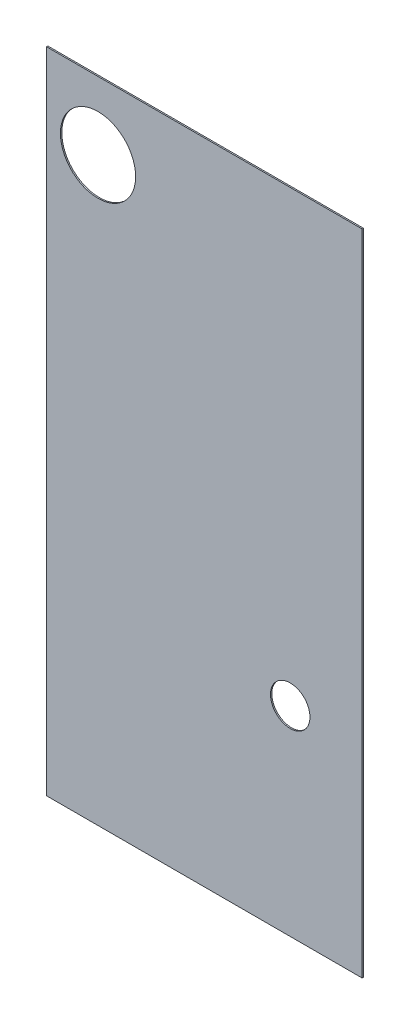
ISO-10303-21;
HEADER;
FILE_DESCRIPTION(('STEP AP214'),'2;1');
FILE_NAME('part.step','',(''),(''),'','','');
FILE_SCHEMA(('AUTOMOTIVE_DESIGN { 1 0 10303 214 1 1 1 1 }'));
ENDSEC;
DATA;
#1=APPLICATION_CONTEXT('core data for automotive mechanical design processes');
#2=APPLICATION_PROTOCOL_DEFINITION('international standard','automotive_design',2000,#1);
#3=PRODUCT_CONTEXT('',#1,'mechanical');
#4=PRODUCT('Part','Part','',(#3));
#5=PRODUCT_RELATED_PRODUCT_CATEGORY('part','',(#4));
#6=PRODUCT_DEFINITION_FORMATION('','',#4);
#7=PRODUCT_DEFINITION_CONTEXT('part definition',#1,'design');
#8=PRODUCT_DEFINITION('design','',#6,#7);
#9=PRODUCT_DEFINITION_SHAPE('','',#8);
#10=(LENGTH_UNIT() NAMED_UNIT(*) SI_UNIT(.MILLI.,.METRE.));
#11=(NAMED_UNIT(*) PLANE_ANGLE_UNIT() SI_UNIT($,.RADIAN.));
#12=(NAMED_UNIT(*) SI_UNIT($,.STERADIAN.) SOLID_ANGLE_UNIT());
#13=UNCERTAINTY_MEASURE_WITH_UNIT(LENGTH_MEASURE(1.E-05),#10,'distance_accuracy_value','');
#14=(GEOMETRIC_REPRESENTATION_CONTEXT(3) GLOBAL_UNCERTAINTY_ASSIGNED_CONTEXT((#13)) GLOBAL_UNIT_ASSIGNED_CONTEXT((#10,
#11,#12)) REPRESENTATION_CONTEXT('',''));
#15=CARTESIAN_POINT('',(0.,0.,0.));
#16=DIRECTION('',(0.,0.,1.));
#17=DIRECTION('',(1.,0.,0.));
#18=AXIS2_PLACEMENT_3D('',#15,#16,#17);
#19=CARTESIAN_POINT('',(-13.7388596639054,1442.54174589611,2.54));
#20=DIRECTION('',(-1.,0.,0.));
#21=DIRECTION('',(0.,0.,1.));
#22=AXIS2_PLACEMENT_3D('',#19,#20,#21);
#23=PLANE('',#22);
#24=DIRECTION('',(0.,1.,0.));
#25=VECTOR('',#24,1.);
#26=CARTESIAN_POINT('',(-13.7388596639054,1442.54174589611,0.));
#27=LINE('',#26,#25);
#28=CARTESIAN_POINT('',(-13.7388596639054,198.597905230073,0.));
#29=VERTEX_POINT('',#28);
#30=CARTESIAN_POINT('',(-13.7388596639054,1442.54174589611,0.));
#31=VERTEX_POINT('',#30);
#32=EDGE_CURVE('E96',#29,#31,#27,.T.);
#33=ORIENTED_EDGE('',*,*,#32,.T.);
#34=DIRECTION('',(0.,0.,-1.));
#35=VECTOR('',#34,1.);
#36=CARTESIAN_POINT('',(-13.7388596639054,1442.54174589611,2.54));
#37=LINE('',#36,#35);
#38=CARTESIAN_POINT('',(-13.7388596639054,1442.54174589611,2.54));
#39=VERTEX_POINT('',#38);
#40=EDGE_CURVE('E11',#39,#31,#37,.T.);
#41=ORIENTED_EDGE('',*,*,#40,.F.);
#42=DIRECTION('',(0.,1.,0.));
#43=VECTOR('',#42,1.);
#44=CARTESIAN_POINT('',(-13.7388596639054,1442.54174589611,2.54));
#45=LINE('',#44,#43);
#46=CARTESIAN_POINT('',(-13.7388596639054,198.597905230073,2.54));
#47=VERTEX_POINT('',#46);
#48=EDGE_CURVE('E84',#47,#39,#45,.T.);
#49=ORIENTED_EDGE('',*,*,#48,.F.);
#50=DIRECTION('',(0.,0.,-1.));
#51=VECTOR('',#50,1.);
#52=CARTESIAN_POINT('',(-13.7388596639054,198.597905230073,2.54));
#53=LINE('',#52,#51);
#54=EDGE_CURVE('E92',#47,#29,#53,.T.);
#55=ORIENTED_EDGE('',*,*,#54,.T.);
#56=EDGE_LOOP('',(#33,#41,#49,#55));
#57=FACE_BOUND('',#56,.T.);
#58=ADVANCED_FACE('F33',(#57),#23,.F.);
#59=CARTESIAN_POINT('',(-13.7388596639054,1442.54174589611,2.54));
#60=DIRECTION('',(0.,-1.,0.));
#61=DIRECTION('',(0.,0.,-1.));
#62=AXIS2_PLACEMENT_3D('',#59,#60,#61);
#63=PLANE('',#62);
#64=DIRECTION('',(-1.,0.,0.));
#65=VECTOR('',#64,1.);
#66=CARTESIAN_POINT('',(-13.7388596639054,1442.54174589611,0.));
#67=LINE('',#66,#65);
#68=CARTESIAN_POINT('',(-618.821804827896,1442.54174589611,0.));
#69=VERTEX_POINT('',#68);
#70=EDGE_CURVE('E88',#31,#69,#67,.T.);
#71=ORIENTED_EDGE('',*,*,#70,.T.);
#72=DIRECTION('',(0.,0.,-1.));
#73=VECTOR('',#72,1.);
#74=CARTESIAN_POINT('',(-618.821804827896,1442.54174589611,2.54));
#75=LINE('',#74,#73);
#76=CARTESIAN_POINT('',(-618.821804827896,1442.54174589611,2.54));
#77=VERTEX_POINT('',#76);
#78=EDGE_CURVE('E41',#77,#69,#75,.T.);
#79=ORIENTED_EDGE('',*,*,#78,.F.);
#80=DIRECTION('',(-1.,0.,0.));
#81=VECTOR('',#80,1.);
#82=CARTESIAN_POINT('',(-13.7388596639054,1442.54174589611,2.54));
#83=LINE('',#82,#81);
#84=EDGE_CURVE('E79',#39,#77,#83,.T.);
#85=ORIENTED_EDGE('',*,*,#84,.F.);
#86=ORIENTED_EDGE('',*,*,#40,.T.);
#87=EDGE_LOOP('',(#71,#79,#85,#86));
#88=FACE_BOUND('',#87,.T.);
#89=ADVANCED_FACE('F87',(#88),#63,.F.);
#90=CARTESIAN_POINT('',(-618.821804827896,1442.54174589611,2.54));
#91=DIRECTION('',(1.,0.,0.));
#92=DIRECTION('',(0.,0.,-1.));
#93=AXIS2_PLACEMENT_3D('',#90,#91,#92);
#94=PLANE('',#93);
#95=DIRECTION('',(0.,-1.,0.));
#96=VECTOR('',#95,1.);
#97=CARTESIAN_POINT('',(-618.821804827896,1442.54174589611,0.));
#98=LINE('',#97,#96);
#99=CARTESIAN_POINT('',(-618.821804827896,198.597905230073,0.));
#100=VERTEX_POINT('',#99);
#101=EDGE_CURVE('E66',#69,#100,#98,.T.);
#102=ORIENTED_EDGE('',*,*,#101,.T.);
#103=DIRECTION('',(0.,0.,-1.));
#104=VECTOR('',#103,1.);
#105=CARTESIAN_POINT('',(-618.821804827896,198.597905230073,2.54));
#106=LINE('',#105,#104);
#107=CARTESIAN_POINT('',(-618.821804827896,198.597905230073,2.54));
#108=VERTEX_POINT('',#107);
#109=EDGE_CURVE('E89',#108,#100,#106,.T.);
#110=ORIENTED_EDGE('',*,*,#109,.F.);
#111=DIRECTION('',(0.,-1.,0.));
#112=VECTOR('',#111,1.);
#113=CARTESIAN_POINT('',(-618.821804827896,1442.54174589611,2.54));
#114=LINE('',#113,#112);
#115=EDGE_CURVE('E82',#77,#108,#114,.T.);
#116=ORIENTED_EDGE('',*,*,#115,.F.);
#117=ORIENTED_EDGE('',*,*,#78,.T.);
#118=EDGE_LOOP('',(#102,#110,#116,#117));
#119=FACE_BOUND('',#118,.T.);
#120=ADVANCED_FACE('F90',(#119),#94,.F.);
#121=CARTESIAN_POINT('',(-13.7388596639054,198.597905230073,2.54));
#122=DIRECTION('',(0.,1.,0.));
#123=DIRECTION('',(0.,0.,1.));
#124=AXIS2_PLACEMENT_3D('',#121,#122,#123);
#125=PLANE('',#124);
#126=DIRECTION('',(1.,0.,0.));
#127=VECTOR('',#126,1.);
#128=CARTESIAN_POINT('',(-13.7388596639054,198.597905230073,0.));
#129=LINE('',#128,#127);
#130=EDGE_CURVE('E72',#100,#29,#129,.T.);
#131=ORIENTED_EDGE('',*,*,#130,.T.);
#132=ORIENTED_EDGE('',*,*,#54,.F.);
#133=DIRECTION('',(1.,0.,0.));
#134=VECTOR('',#133,1.);
#135=CARTESIAN_POINT('',(-13.7388596639054,198.597905230073,2.54));
#136=LINE('',#135,#134);
#137=EDGE_CURVE('E49',#108,#47,#136,.T.);
#138=ORIENTED_EDGE('',*,*,#137,.F.);
#139=ORIENTED_EDGE('',*,*,#109,.T.);
#140=EDGE_LOOP('',(#131,#132,#138,#139));
#141=FACE_BOUND('',#140,.T.);
#142=ADVANCED_FACE('F104',(#141),#125,.F.);
#143=CARTESIAN_POINT('',(0.,0.,2.54));
#144=DIRECTION('',(0.,0.,-1.));
#145=DIRECTION('',(-1.,0.,0.));
#146=AXIS2_PLACEMENT_3D('',#143,#144,#145);
#147=PLANE('',#146);
#148=CARTESIAN_POINT('',(-520.126168734387,1312.22667083222,2.54));
#149=DIRECTION('',(0.,0.,-1.));
#150=DIRECTION('',(-1.,0.,0.));
#151=AXIS2_PLACEMENT_3D('',#148,#149,#150);
#152=CIRCLE('',#151,72.0724503701328);
#153=CARTESIAN_POINT('',(-592.19861910452,1312.22667083222,2.54));
#154=VERTEX_POINT('',#153);
#155=EDGE_CURVE('E99',#154,#154,#152,.T.);
#156=ORIENTED_EDGE('',*,*,#155,.T.);
#157=EDGE_LOOP('',(#156));
#158=FACE_BOUND('',#157,.T.);
#159=CARTESIAN_POINT('',(-151.601482636722,581.817383071083,2.54));
#160=DIRECTION('',(0.,0.,-1.));
#161=DIRECTION('',(-1.,0.,0.));
#162=AXIS2_PLACEMENT_3D('',#159,#160,#161);
#163=CIRCLE('',#162,37.8543054622462);
#164=CARTESIAN_POINT('',(-189.455788098968,581.817383071083,2.54));
#165=VERTEX_POINT('',#164);
#166=EDGE_CURVE('E112',#165,#165,#163,.T.);
#167=ORIENTED_EDGE('',*,*,#166,.T.);
#168=EDGE_LOOP('',(#167));
#169=FACE_BOUND('',#168,.T.);
#170=ORIENTED_EDGE('',*,*,#48,.T.);
#171=ORIENTED_EDGE('',*,*,#84,.T.);
#172=ORIENTED_EDGE('',*,*,#115,.T.);
#173=ORIENTED_EDGE('',*,*,#137,.T.);
#174=EDGE_LOOP('',(#170,#171,#172,#173));
#175=FACE_BOUND('',#174,.T.);
#176=ADVANCED_FACE('F80',(#158,#169,#175),#147,.F.);
#177=CARTESIAN_POINT('',(0.,0.,0.));
#178=DIRECTION('',(0.,0.,-1.));
#179=DIRECTION('',(-1.,0.,0.));
#180=AXIS2_PLACEMENT_3D('',#177,#178,#179);
#181=PLANE('',#180);
#182=CARTESIAN_POINT('',(-520.126168734387,1312.22667083222,0.));
#183=DIRECTION('',(0.,0.,1.));
#184=DIRECTION('',(1.,0.,0.));
#185=AXIS2_PLACEMENT_3D('',#182,#183,#184);
#186=CIRCLE('',#185,72.0724503701328);
#187=CARTESIAN_POINT('',(-448.053718364254,1312.22667083222,0.));
#188=VERTEX_POINT('',#187);
#189=EDGE_CURVE('E115',#188,#188,#186,.T.);
#190=ORIENTED_EDGE('',*,*,#189,.T.);
#191=EDGE_LOOP('',(#190));
#192=FACE_BOUND('',#191,.T.);
#193=CARTESIAN_POINT('',(-151.601482636722,581.817383071083,0.));
#194=DIRECTION('',(0.,0.,1.));
#195=DIRECTION('',(1.,0.,0.));
#196=AXIS2_PLACEMENT_3D('',#193,#194,#195);
#197=CIRCLE('',#196,37.8543054622462);
#198=CARTESIAN_POINT('',(-113.747177174475,581.817383071083,0.));
#199=VERTEX_POINT('',#198);
#200=EDGE_CURVE('E116',#199,#199,#197,.T.);
#201=ORIENTED_EDGE('',*,*,#200,.T.);
#202=EDGE_LOOP('',(#201));
#203=FACE_BOUND('',#202,.T.);
#204=ORIENTED_EDGE('',*,*,#32,.F.);
#205=ORIENTED_EDGE('',*,*,#130,.F.);
#206=ORIENTED_EDGE('',*,*,#101,.F.);
#207=ORIENTED_EDGE('',*,*,#70,.F.);
#208=EDGE_LOOP('',(#204,#205,#206,#207));
#209=FACE_BOUND('',#208,.T.);
#210=ADVANCED_FACE('F107',(#192,#203,#209),#181,.T.);
#211=CARTESIAN_POINT('',(-151.601482636722,581.817383071083,0.));
#212=DIRECTION('',(0.,0.,1.));
#213=DIRECTION('',(1.,0.,0.));
#214=AXIS2_PLACEMENT_3D('',#211,#212,#213);
#215=CYLINDRICAL_SURFACE('',#214,37.8543054622462);
#216=ORIENTED_EDGE('',*,*,#200,.F.);
#217=EDGE_LOOP('',(#216));
#218=FACE_BOUND('',#217,.T.);
#219=ORIENTED_EDGE('',*,*,#166,.F.);
#220=EDGE_LOOP('',(#219));
#221=FACE_BOUND('',#220,.T.);
#222=ADVANCED_FACE('F127',(#218,#221),#215,.F.);
#223=CARTESIAN_POINT('',(-520.126168734387,1312.22667083222,0.));
#224=DIRECTION('',(0.,0.,1.));
#225=DIRECTION('',(1.,0.,0.));
#226=AXIS2_PLACEMENT_3D('',#223,#224,#225);
#227=CYLINDRICAL_SURFACE('',#226,72.0724503701328);
#228=ORIENTED_EDGE('',*,*,#189,.F.);
#229=EDGE_LOOP('',(#228));
#230=FACE_BOUND('',#229,.T.);
#231=ORIENTED_EDGE('',*,*,#155,.F.);
#232=EDGE_LOOP('',(#231));
#233=FACE_BOUND('',#232,.T.);
#234=ADVANCED_FACE('F124',(#230,#233),#227,.F.);
#235=CLOSED_SHELL('',(#58,#89,#120,#142,#176,#210,#222,#234));
#236=MANIFOLD_SOLID_BREP('B2',#235);
#237=ADVANCED_BREP_SHAPE_REPRESENTATION('',(#18,#236),#14);
#238=SHAPE_DEFINITION_REPRESENTATION(#9,#237);
ENDSEC;
END-ISO-10303-21;
